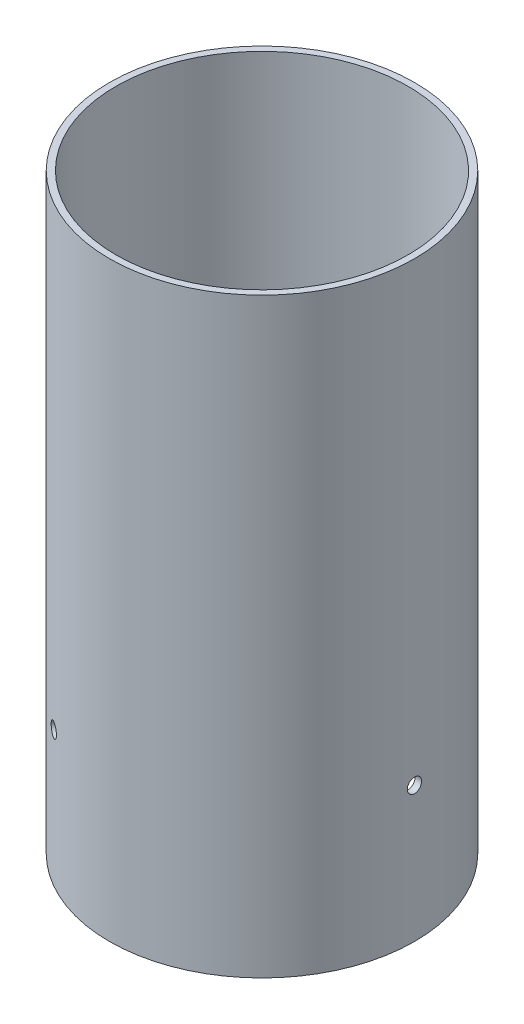
ISO-10303-21;
HEADER;
FILE_DESCRIPTION(('STEP AP214'),'2;1');
FILE_NAME('part.step','',(''),(''),'','','');
FILE_SCHEMA(('AUTOMOTIVE_DESIGN { 1 0 10303 214 1 1 1 1 }'));
ENDSEC;
DATA;
#1=APPLICATION_CONTEXT('core data for automotive mechanical design processes');
#2=APPLICATION_PROTOCOL_DEFINITION('international standard','automotive_design',2000,#1);
#3=PRODUCT_CONTEXT('',#1,'mechanical');
#4=PRODUCT('Part','Part','',(#3));
#5=PRODUCT_RELATED_PRODUCT_CATEGORY('part','',(#4));
#6=PRODUCT_DEFINITION_FORMATION('','',#4);
#7=PRODUCT_DEFINITION_CONTEXT('part definition',#1,'design');
#8=PRODUCT_DEFINITION('design','',#6,#7);
#9=PRODUCT_DEFINITION_SHAPE('','',#8);
#10=(LENGTH_UNIT() NAMED_UNIT(*) SI_UNIT(.MILLI.,.METRE.));
#11=(NAMED_UNIT(*) PLANE_ANGLE_UNIT() SI_UNIT($,.RADIAN.));
#12=(NAMED_UNIT(*) SI_UNIT($,.STERADIAN.) SOLID_ANGLE_UNIT());
#13=UNCERTAINTY_MEASURE_WITH_UNIT(LENGTH_MEASURE(1.E-05),#10,'distance_accuracy_value','');
#14=(GEOMETRIC_REPRESENTATION_CONTEXT(3) GLOBAL_UNCERTAINTY_ASSIGNED_CONTEXT((#13)) GLOBAL_UNIT_ASSIGNED_CONTEXT((#10,
#11,#12)) REPRESENTATION_CONTEXT('',''));
#15=CARTESIAN_POINT('',(0.,0.,0.));
#16=DIRECTION('',(0.,0.,1.));
#17=DIRECTION('',(1.,0.,0.));
#18=AXIS2_PLACEMENT_3D('',#15,#16,#17);
#19=CARTESIAN_POINT('',(0.,147.8153,0.));
#20=DIRECTION('',(0.,1.,0.));
#21=DIRECTION('',(0.,0.,1.));
#22=AXIS2_PLACEMENT_3D('',#19,#20,#21);
#23=PLANE('',#22);
#24=CARTESIAN_POINT('',(0.,147.8153,0.));
#25=DIRECTION('',(0.,1.,0.));
#26=DIRECTION('',(0.,0.,1.));
#27=AXIS2_PLACEMENT_3D('',#24,#25,#26);
#28=CIRCLE('',#27,38.1381);
#29=CARTESIAN_POINT('',(0.,147.8153,38.1381));
#30=VERTEX_POINT('',#29);
#31=EDGE_CURVE('E10',#30,#30,#28,.T.);
#32=ORIENTED_EDGE('',*,*,#31,.T.);
#33=EDGE_LOOP('',(#32));
#34=FACE_BOUND('',#33,.T.);
#35=CARTESIAN_POINT('',(0.,147.8153,0.));
#36=DIRECTION('',(0.,1.,0.));
#37=DIRECTION('',(0.,0.,1.));
#38=AXIS2_PLACEMENT_3D('',#35,#36,#37);
#39=CIRCLE('',#38,36.5125);
#40=CARTESIAN_POINT('',(0.,147.8153,36.5125));
#41=VERTEX_POINT('',#40);
#42=EDGE_CURVE('E44',#41,#41,#39,.T.);
#43=ORIENTED_EDGE('',*,*,#42,.F.);
#44=EDGE_LOOP('',(#43));
#45=FACE_BOUND('',#44,.T.);
#46=ADVANCED_FACE('F33',(#34,#45),#23,.T.);
#47=CARTESIAN_POINT('',(0.,0.,0.));
#48=DIRECTION('',(0.,1.,0.));
#49=DIRECTION('',(0.,0.,1.));
#50=AXIS2_PLACEMENT_3D('',#47,#48,#49);
#51=PLANE('',#50);
#52=CARTESIAN_POINT('',(0.,0.,0.));
#53=DIRECTION('',(0.,1.,0.));
#54=DIRECTION('',(0.,0.,1.));
#55=AXIS2_PLACEMENT_3D('',#52,#53,#54);
#56=CIRCLE('',#55,38.1381);
#57=CARTESIAN_POINT('',(0.,0.,38.1381));
#58=VERTEX_POINT('',#57);
#59=EDGE_CURVE('E37',#58,#58,#56,.T.);
#60=ORIENTED_EDGE('',*,*,#59,.F.);
#61=EDGE_LOOP('',(#60));
#62=FACE_BOUND('',#61,.T.);
#63=CARTESIAN_POINT('',(0.,0.,0.));
#64=DIRECTION('',(0.,1.,0.));
#65=DIRECTION('',(0.,0.,1.));
#66=AXIS2_PLACEMENT_3D('',#63,#64,#65);
#67=CIRCLE('',#66,36.5125);
#68=CARTESIAN_POINT('',(0.,0.,36.5125));
#69=VERTEX_POINT('',#68);
#70=EDGE_CURVE('E46',#69,#69,#67,.T.);
#71=ORIENTED_EDGE('',*,*,#70,.T.);
#72=EDGE_LOOP('',(#71));
#73=FACE_BOUND('',#72,.T.);
#74=ADVANCED_FACE('F116',(#62,#73),#51,.F.);
#75=CARTESIAN_POINT('',(0.,147.8153,0.));
#76=DIRECTION('',(0.,-1.,0.));
#77=DIRECTION('',(0.,0.,-1.));
#78=AXIS2_PLACEMENT_3D('',#75,#76,#77);
#79=CYLINDRICAL_SURFACE('',#78,38.1381);
#80=CARTESIAN_POINT('',(-17.5014632336155,33.8074,33.8852985274205));
#81=CARTESIAN_POINT('',(-17.501467349219,33.9076578687469,33.8852968008197));
#82=CARTESIAN_POINT('',(-17.508999065726,34.0079870339223,33.8814096230945));
#83=CARTESIAN_POINT('',(-17.5389215941936,34.205878197048,33.8659293942136));
#84=CARTESIAN_POINT('',(-17.5613299602515,34.3034367837977,33.85432723954));
#85=CARTESIAN_POINT('',(-17.6203141855438,34.4928914651225,33.8236647641002));
#86=CARTESIAN_POINT('',(-17.6568828784673,34.5847903967336,33.8046082158315));
#87=CARTESIAN_POINT('',(-17.7430638212488,34.7603432783211,33.7594536817781));
#88=CARTESIAN_POINT('',(-17.792672972035,34.8439991807722,33.7333573689586));
#89=CARTESIAN_POINT('',(-17.9034840121713,35.0007921425403,33.6746767440669));
#90=CARTESIAN_POINT('',(-17.9646950271793,35.0739208412828,33.6420873236829));
#91=CARTESIAN_POINT('',(-18.0968533022114,35.2075123586161,33.5711808496157));
#92=CARTESIAN_POINT('',(-18.1678009575859,35.2679746626434,33.5328635633504));
#93=CARTESIAN_POINT('',(-18.3173592830159,35.3745390488251,33.4514015191992));
#94=CARTESIAN_POINT('',(-18.3959733221843,35.4206347796843,33.4082546376291));
#95=CARTESIAN_POINT('',(-18.5585260587089,35.4971167209652,33.3182293245103));
#96=CARTESIAN_POINT('',(-18.6424647194058,35.5275030395305,33.2713509186521));
#97=CARTESIAN_POINT('',(-18.8131603751818,35.5716819567595,33.1751300658714));
#98=CARTESIAN_POINT('',(-18.8999152369714,35.5854868280182,33.1257894695229));
#99=CARTESIAN_POINT('',(-19.0738088012202,35.5961488477628,33.0259676432805));
#100=CARTESIAN_POINT('',(-19.1609475009398,35.5930061170072,32.9754864215167));
#101=CARTESIAN_POINT('',(-19.3330697199145,35.5698723474202,32.8748691177054));
#102=CARTESIAN_POINT('',(-19.418054875546,35.5498945218934,32.8247327960607));
#103=CARTESIAN_POINT('',(-19.583569892321,35.4936781366245,32.7262546252417));
#104=CARTESIAN_POINT('',(-19.6640997364757,35.4574395148824,32.6779127829103));
#105=CARTESIAN_POINT('',(-19.8185219457185,35.3697151326098,32.5844904179342));
#106=CARTESIAN_POINT('',(-19.892411671933,35.3182233448836,32.5394111932713));
#107=CARTESIAN_POINT('',(-20.0315166435133,35.2014587034356,32.4539625790467));
#108=CARTESIAN_POINT('',(-20.0967318355649,35.1361857650204,32.4135932184323));
#109=CARTESIAN_POINT('',(-20.2168010405188,34.9936369669281,32.3388411258981));
#110=CARTESIAN_POINT('',(-20.2716450461268,34.9163496440811,32.3044641786123));
#111=CARTESIAN_POINT('',(-20.369438174186,34.7520062782388,32.2428908495348));
#112=CARTESIAN_POINT('',(-20.4123872937555,34.6649502328769,32.2156944694826));
#113=CARTESIAN_POINT('',(-20.4852583357616,34.4835337335853,32.1694068226873));
#114=CARTESIAN_POINT('',(-20.5151798986683,34.3891730781501,32.1503157796327));
#115=CARTESIAN_POINT('',(-20.561206444117,34.1958290196872,32.1208999508396));
#116=CARTESIAN_POINT('',(-20.577311517821,34.0968456471649,32.1105751072611));
#117=CARTESIAN_POINT('',(-20.595273484249,33.8971665940379,32.0990575866162));
#118=CARTESIAN_POINT('',(-20.597143893939,33.7964726288875,32.0978562460472));
#119=CARTESIAN_POINT('',(-20.5866231403947,33.5961422470756,32.1046049164172));
#120=CARTESIAN_POINT('',(-20.5742320184312,33.4965058273547,32.1125549008735));
#121=CARTESIAN_POINT('',(-20.5355220520146,33.3011638380275,32.1373229722597));
#122=CARTESIAN_POINT('',(-20.50920939702,33.2054565419093,32.1541371182066));
#123=CARTESIAN_POINT('',(-20.4433503288636,33.0206364223301,32.196049659695));
#124=CARTESIAN_POINT('',(-20.4038038486634,32.9315236322774,32.2211480972021));
#125=CARTESIAN_POINT('',(-20.3124821865116,32.7623483055533,32.278795607632));
#126=CARTESIAN_POINT('',(-20.2606977969633,32.6822926507096,32.3113502899361));
#127=CARTESIAN_POINT('',(-20.1462864687058,32.5335732855632,32.3828094851312));
#128=CARTESIAN_POINT('',(-20.0836594686947,32.4649096396729,32.421714033923));
#129=CARTESIAN_POINT('',(-19.9491818321175,32.3408695739021,32.5046311874835));
#130=CARTESIAN_POINT('',(-19.8773240734296,32.2855035096205,32.5486477339441));
#131=CARTESIAN_POINT('',(-19.7263669675379,32.1897010321337,32.6403570320063));
#132=CARTESIAN_POINT('',(-19.6472676489548,32.1492645599254,32.6880497690783));
#133=CARTESIAN_POINT('',(-19.4840319330606,32.084487234282,32.7856096633245));
#134=CARTESIAN_POINT('',(-19.3998976295519,32.0601397402629,32.8354759143297));
#135=CARTESIAN_POINT('',(-19.2289060520162,32.028209756078,32.9359024547704));
#136=CARTESIAN_POINT('',(-19.1420487908613,32.0206271866717,32.9864627409244));
#137=CARTESIAN_POINT('',(-18.9681508668178,32.022443068198,33.0867645792259));
#138=CARTESIAN_POINT('',(-18.8811104591919,32.0318252655729,33.1365068690075));
#139=CARTESIAN_POINT('',(-18.7092530191418,32.0672707808457,33.2338423843089));
#140=CARTESIAN_POINT('',(-18.6244359909555,32.0933341305366,33.2814356057326));
#141=CARTESIAN_POINT('',(-18.4594798888871,32.1613988900873,33.3732106648531));
#142=CARTESIAN_POINT('',(-18.3793408605228,32.2034004549993,33.4173924693574));
#143=CARTESIAN_POINT('',(-18.2260878657308,32.3021463301724,33.5012243290482));
#144=CARTESIAN_POINT('',(-18.1529736764123,32.3588901724648,33.5408745280253));
#145=CARTESIAN_POINT('',(-18.015868143754,32.4855672360272,33.6147177026454));
#146=CARTESIAN_POINT('',(-17.9518846003812,32.5555116169684,33.6489060153489));
#147=CARTESIAN_POINT('',(-17.8350110289078,32.7066001733453,33.7109988811533));
#148=CARTESIAN_POINT('',(-17.7821237373999,32.7877471034271,33.7389018842759));
#149=CARTESIAN_POINT('',(-17.6890181436651,32.9589949189407,33.7878097201873));
#150=CARTESIAN_POINT('',(-17.6488112777457,33.0491037912539,33.8088083267147));
#151=CARTESIAN_POINT('',(-17.5823942894019,33.2355925870745,33.8433966689575));
#152=CARTESIAN_POINT('',(-17.5561676040917,33.3319649373638,33.8569951722755));
#153=CARTESIAN_POINT('',(-17.5254064854518,33.4920150071967,33.8729237871435));
#154=CARTESIAN_POINT('',(-17.516439932421,33.5546556126158,33.8775596798369));
#155=CARTESIAN_POINT('',(-17.5044670077013,33.6806546460333,33.8837475946384));
#156=CARTESIAN_POINT('',(-17.5014606315708,33.7440130734968,33.8852996190447));
#157=CARTESIAN_POINT('',(-17.5014632336155,33.8074,33.8852985274205));
#158=B_SPLINE_CURVE_WITH_KNOTS('',3,(#80,#81,#82,#83,#84,#85,#86,#87,#88,#89,#90,#91,#92,#93,
#94,#95,#96,#97,#98,#99,#100,#101,#102,#103,#104,#105,#106,#107,#108,#109,#110,#111,#112,#113,
#114,#115,#116,#117,#118,#119,#120,#121,#122,#123,#124,#125,#126,#127,#128,#129,#130,#131,#132,
#133,#134,#135,#136,#137,#138,#139,#140,#141,#142,#143,#144,#145,#146,#147,#148,#149,#150,#151,
#152,#153,#154,#155,#156,#157),.UNSPECIFIED.,.T.,.F.,(4,2,2,2,2,2,2,2,2,2,2,2,2,2,2,2,2,2,2,2,2,
2,2,2,2,2,2,2,2,2,2,2,2,2,2,2,2,2,4),(0.,0.30054222269631,0.601439709975831,0.902185116537959,
1.20285911531018,1.50377060360109,1.80469431384009,2.1057508708664,2.40680535539062,
2.70763687982766,3.00846626072007,3.30905975033448,3.60965438607756,3.9103679587644,
4.21108337957105,4.51208750037112,4.8130916940894,5.11410419428654,5.41511470836723,
5.71583935288382,6.01656312714919,6.31715331302587,6.61774502161876,6.91856361444067,
7.21938390808641,7.52043771383772,7.82149032978512,8.12241861117601,8.42334547020756,
8.72398417080085,9.0246234443924,9.32526564277497,9.62589829894312,9.92678625628239,
10.2277483325598,10.5289810714218,10.8298561299779,11.0198707614112,11.2098852512392),.UNSPECIFIED.);
#159=CARTESIAN_POINT('',(-17.5014632336155,33.8074,33.8852985274205));
#160=VERTEX_POINT('',#159);
#161=EDGE_CURVE('E98',#160,#160,#158,.T.);
#162=ORIENTED_EDGE('',*,*,#161,.F.);
#163=EDGE_LOOP('',(#162));
#164=FACE_BOUND('',#163,.T.);
#165=CARTESIAN_POINT('',(-20.5947977227576,33.8074,-32.0993610274207));
#166=CARTESIAN_POINT('',(-20.5947941696758,33.9076578687469,-32.0993637283375));
#167=CARTESIAN_POINT('',(-20.5876619167632,34.0079870339223,-32.1039427973041));
#168=CARTESIAN_POINT('',(-20.5592943810622,34.205878197048,-32.122116352662));
#169=CARTESIAN_POINT('',(-20.5380424373473,34.3034367837977,-32.1357214895887));
#170=CARTESIAN_POINT('',(-20.4819958420273,34.4928914651225,-32.1714720893944));
#171=CARTESIAN_POINT('',(-20.4472080406564,34.5847903967336,-32.193613232315));
#172=CARTESIAN_POINT('',(-20.3650125956794,34.7603432783211,-32.2456708510592));
#173=CARTESIAN_POINT('',(-20.3176079504394,34.8439991807721,-32.2755854794905));
#174=CARTESIAN_POINT('',(-20.2113835185052,35.0007921425403,-32.3422103428224));
#175=CARTESIAN_POINT('',(-20.152554745054,35.0739208412828,-32.3789259266187));
#176=CARTESIAN_POINT('',(-20.025068799703,35.2075123586161,-32.4579251130833));
#177=CARTESIAN_POINT('',(-19.9564112287059,35.2679746626434,-32.500208941844));
#178=CARTESIAN_POINT('',(-19.8110838663118,35.3745390488251,-32.5889992289381));
#179=CARTESIAN_POINT('',(-19.7344105511938,35.4206347796843,-32.6355075431671));
#180=CARTESIAN_POINT('',(-19.575169974787,35.4971167209652,-32.7312696858926));
#181=CARTESIAN_POINT('',(-19.4926027540764,35.5275030395305,-32.7805234954867));
#182=CARTESIAN_POINT('',(-19.3239252233066,35.5716819567595,-32.880239843314));
#183=CARTESIAN_POINT('',(-19.237817582536,35.5854868280182,-32.9307014593514));
#184=CARTESIAN_POINT('',(-19.0644225630336,35.5961488477628,-33.0313867904242));
#185=CARTESIAN_POINT('',(-18.9771351927122,35.5930061170072,-33.0816105071523));
#186=CARTESIAN_POINT('',(-18.803936942064,35.5698723474202,-33.1803640694344));
#187=CARTESIAN_POINT('',(-18.7180250360516,35.5498945218934,-33.2288952123336));
#188=CARTESIAN_POINT('',(-18.5499829300166,35.4936781366245,-33.322996336159));
#189=CARTESIAN_POINT('',(-18.4678527444145,35.4574395148824,-33.3685663057941));
#190=CARTESIAN_POINT('',(-18.3097354984422,35.3697151326098,-33.4555886794188));
#191=CARTESIAN_POINT('',(-18.233750881594,35.3182233448836,-33.4970394470678));
#192=CARTESIAN_POINT('',(-18.0901977251672,35.2014587034356,-33.5747835791368));
#193=CARTESIAN_POINT('',(-18.0226292373148,35.1361857650204,-33.6110769118589));
#194=CARTESIAN_POINT('',(-17.8978574237172,34.9936369669281,-33.6776838472941));
#195=CARTESIAN_POINT('',(-17.8406641112591,34.9163496440811,-33.7079916757531));
#196=CARTESIAN_POINT('',(-17.7384434800528,34.7520062782388,-33.7618963444291));
#197=CARTESIAN_POINT('',(-17.6934161642519,34.6649502328769,-33.7854931830203));
#198=CARTESIAN_POINT('',(-17.6168943652427,34.4835337335853,-33.8254575332002));
#199=CARTESIAN_POINT('',(-17.5854002555193,34.3891730781501,-33.841824845271));
#200=CARTESIAN_POINT('',(-17.5369121277868,34.1958290196872,-33.8669770884814));
#201=CARTESIAN_POINT('',(-17.5199180141057,34.0968456471649,-33.8757620696497));
#202=CARTESIAN_POINT('',(-17.5009625654246,33.8971665940379,-33.8855588285559));
#203=CARTESIAN_POINT('',(-17.4989869691283,33.7964726288875,-33.8865779805784));
#204=CARTESIAN_POINT('',(-17.5100918658825,33.5961422470756,-33.8808410759271));
#205=CARTESIAN_POINT('',(-17.5231723153632,33.4965058273547,-33.8740850417534));
#206=CARTESIAN_POINT('',(-17.5639770775947,33.3011638380275,-33.8529452631501));
#207=CARTESIAN_POINT('',(-17.5916948826249,33.2054565419094,-33.8385649084572));
#208=CARTESIAN_POINT('',(-17.6609217423693,33.0206364223301,-33.8024855531084));
#209=CARTESIAN_POINT('',(-17.7024308669458,32.9315236322775,-33.7807865153784));
#210=CARTESIAN_POINT('',(-17.7980159065189,32.7623483055533,-33.730523391254));
#211=CARTESIAN_POINT('',(-17.8521012831806,32.6822926507096,-33.7019541355377));
#212=CARTESIAN_POINT('',(-17.9711924256823,32.5335732855632,-33.6386006163836));
#213=CARTESIAN_POINT('',(-18.0361982532643,32.4649096396729,-33.603816317807));
#214=CARTESIAN_POINT('',(-18.1752454329457,32.3408695739021,-33.5288138450706));
#215=CARTESIAN_POINT('',(-18.2492937597114,32.2855035096205,-33.4885914738182));
#216=CARTESIAN_POINT('',(-18.4041948945424,32.1897010321337,-33.4037134342652));
#217=CARTESIAN_POINT('',(-18.4850476757143,32.1492645599254,-33.3590577834863));
#218=CARTESIAN_POINT('',(-18.6511548804692,32.084487234282,-33.2664714538401));
#219=CARTESIAN_POINT('',(-18.7364074723854,32.0601397402629,-33.2185421351744));
#220=CARTESIAN_POINT('',(-18.9088751963892,32.028209756078,-33.1206723554156));
#221=CARTESIAN_POINT('',(-18.9960903191986,32.0206271866717,-33.0707319038294));
#222=CARTESIAN_POINT('',(-19.1699032212357,32.022443068198,-32.970282803093));
#223=CARTESIAN_POINT('',(-19.2565015116419,32.0318252655729,-32.9197747438241));
#224=CARTESIAN_POINT('',(-19.4267252606085,32.0672707808457,-32.8196095925621));
#225=CARTESIAN_POINT('',(-19.5103507135025,32.0933341305366,-32.7699525021911));
#226=CARTESIAN_POINT('',(-19.6723082971688,32.1613988900873,-32.6729838568508));
#227=CARTESIAN_POINT('',(-19.7506403764367,32.2034004549993,-32.6256723247049));
#228=CARTESIAN_POINT('',(-19.8998673939714,32.3021463301724,-32.5348672678544));
#229=CARTESIAN_POINT('',(-19.9707625682099,32.3588901724648,-32.491373622016));
#230=CARTESIAN_POINT('',(-20.1032653996562,32.4855672360272,-32.4095583350445));
#231=CARTESIAN_POINT('',(-20.1648651186564,32.5555116169684,-32.3712411174113));
#232=CARTESIAN_POINT('',(-20.2770759035736,32.7066001733453,-32.3010720683865));
#233=CARTESIAN_POINT('',(-20.3276842588735,32.7877471034271,-32.2692218319646));
#234=CARTESIAN_POINT('',(-20.4165924840843,32.9589949189407,-32.2130439405115));
#235=CARTESIAN_POINT('',(-20.4548812437407,33.0491037912539,-32.1887230764825));
#236=CARTESIAN_POINT('',(-20.5180441209697,33.2355925870745,-32.1484984484553));
#237=CARTESIAN_POINT('',(-20.5429341129517,33.3319649373638,-32.1325847243787));
#238=CARTESIAN_POINT('',(-20.5721092573945,33.4920150071967,-32.1139091216217));
#239=CARTESIAN_POINT('',(-20.5806073347516,33.5546556126158,-32.1084618052593));
#240=CARTESIAN_POINT('',(-20.5919526885259,33.6806546460333,-32.1011869056952));
#241=CARTESIAN_POINT('',(-20.5947999691543,33.7440130734968,-32.099359319796));
#242=CARTESIAN_POINT('',(-20.5947977227576,33.8074,-32.0993610274207));
#243=B_SPLINE_CURVE_WITH_KNOTS('',3,(#165,#166,#167,#168,#169,#170,#171,#172,#173,#174,#175,
#176,#177,#178,#179,#180,#181,#182,#183,#184,#185,#186,#187,#188,#189,#190,#191,#192,#193,#194,
#195,#196,#197,#198,#199,#200,#201,#202,#203,#204,#205,#206,#207,#208,#209,#210,#211,#212,#213,
#214,#215,#216,#217,#218,#219,#220,#221,#222,#223,#224,#225,#226,#227,#228,#229,#230,#231,#232,
#233,#234,#235,#236,#237,#238,#239,#240,#241,#242),.UNSPECIFIED.,.T.,.F.,(4,2,2,2,2,2,2,2,2,2,2,
2,2,2,2,2,2,2,2,2,2,2,2,2,2,2,2,2,2,2,2,2,2,2,2,2,2,2,4),(0.,0.30054222269631,0.601439709975832,
0.902185116537959,1.20285911531018,1.50377060360109,1.80469431384009,2.10575087086639,
2.40680535539062,2.70763687982766,3.00846626072008,3.30905975033448,3.60965438607756,
3.9103679587644,4.21108337957105,4.51208750037112,4.81309169408941,5.11410419428654,
5.41511470836724,5.71583935288383,6.01656312714919,6.31715331302586,6.61774502161876,
6.91856361444067,7.21938390808641,7.52043771383773,7.82149032978512,8.12241861117601,
8.42334547020756,8.72398417080085,9.0246234443924,9.32526564277497,9.62589829894312,
9.92678625628239,10.2277483325598,10.5289810714218,10.8298561299779,11.0198707614112,
11.2098852512392),.UNSPECIFIED.);
#244=CARTESIAN_POINT('',(-20.5947977227576,33.8074,-32.0993610274207));
#245=VERTEX_POINT('',#244);
#246=EDGE_CURVE('E75',#245,#245,#243,.T.);
#247=ORIENTED_EDGE('',*,*,#246,.F.);
#248=EDGE_LOOP('',(#247));
#249=FACE_BOUND('',#248,.T.);
#250=CARTESIAN_POINT('',(38.0962609563733,33.8074,-1.7859375));
#251=CARTESIAN_POINT('',(38.0962615188949,33.9076578687469,-1.78593307248244));
#252=CARTESIAN_POINT('',(38.0966609824894,34.0079870339223,-1.77746682579068));
#253=CARTESIAN_POINT('',(38.0982159752559,34.205878197048,-1.74381304155182));
#254=CARTESIAN_POINT('',(38.0993723975989,34.3034367837977,-1.71860574995165));
#255=CARTESIAN_POINT('',(38.1023100275712,34.4928914651225,-1.65219267470606));
#256=CARTESIAN_POINT('',(38.1040909191239,34.5847903967336,-1.61099498351676));
#257=CARTESIAN_POINT('',(38.1080764169283,34.7603432783211,-1.5137828307192));
#258=CARTESIAN_POINT('',(38.1102809224746,34.8439991807722,-1.45777188946837));
#259=CARTESIAN_POINT('',(38.1148675306766,35.0007921425403,-1.33246640124479));
#260=CARTESIAN_POINT('',(38.1172497722334,35.0739208412828,-1.26316139706439));
#261=CARTESIAN_POINT('',(38.1219221019145,35.2075123586161,-1.11325573653268));
#262=CARTESIAN_POINT('',(38.124212186292,35.2679746626434,-1.03265462150673));
#263=CARTESIAN_POINT('',(38.1284431493278,35.3745390488251,-0.862402290261317));
#264=CARTESIAN_POINT('',(38.1303838733782,35.4206347796843,-0.772747094462273));
#265=CARTESIAN_POINT('',(38.133696033496,35.4971167209652,-0.586959638617963));
#266=CARTESIAN_POINT('',(38.1350674734823,35.5275030395305,-0.490827423165673));
#267=CARTESIAN_POINT('',(38.1370855984884,35.5716819567595,-0.294890222557718));
#268=CARTESIAN_POINT('',(38.1377328195076,35.5854868280182,-0.195088010171746));
#269=CARTESIAN_POINT('',(38.1382313642539,35.5961488477628,0.00541914714346489));
#270=CARTESIAN_POINT('',(38.1380826936522,35.5930061170072,0.106124085635308));
#271=CARTESIAN_POINT('',(38.1370066619786,35.5698723474202,0.305494951728732));
#272=CARTESIAN_POINT('',(38.1360799115978,35.5498945218934,0.404162416272602));
#273=CARTESIAN_POINT('',(38.1335528223378,35.4936781366245,0.596741710917084));
#274=CARTESIAN_POINT('',(38.1319524808904,35.4574395148824,0.690653522883571));
#275=CARTESIAN_POINT('',(38.1282574441608,35.3697151326098,0.871098261484329));
#276=CARTESIAN_POINT('',(38.1261625535272,35.3182233448836,0.957628253796231));
#277=CARTESIAN_POINT('',(38.1217143686807,35.2014587034356,1.12082100008981));
#278=CARTESIAN_POINT('',(38.1193610728798,35.1361857650204,1.19748369342633));
#279=CARTESIAN_POINT('',(38.1146584642361,34.9936369669281,1.33884272139567));
#280=CARTESIAN_POINT('',(38.1123091573861,34.9163496440811,1.40352749714048));
#281=CARTESIAN_POINT('',(38.107881654239,34.7520062782388,1.519005494894));
#282=CARTESIAN_POINT('',(38.1058034580075,34.6649502328769,1.56979871353748));
#283=CARTESIAN_POINT('',(38.1021527010044,34.4835337335853,1.65605071051264));
#284=CARTESIAN_POINT('',(38.1005801541877,34.3891730781501,1.69150906563811));
#285=CARTESIAN_POINT('',(38.0981185719039,34.1958290196872,1.74607713764162));
#286=CARTESIAN_POINT('',(38.0972295319268,34.0968456471649,1.76518696238839));
#287=CARTESIAN_POINT('',(38.0962360496738,33.8971665940379,1.78650124193938));
#288=CARTESIAN_POINT('',(38.0961308630674,33.7964726288875,1.78872173453091));
#289=CARTESIAN_POINT('',(38.0967150062774,33.5961422470756,1.77623615950963));
#290=CARTESIAN_POINT('',(38.0974043337945,33.4965058273547,1.76153014087967));
#291=CARTESIAN_POINT('',(38.0994991296094,33.3011638380275,1.71562229089013));
#292=CARTESIAN_POINT('',(38.1009042796451,33.2054565419094,1.68442779025039));
#293=CARTESIAN_POINT('',(38.104272071233,33.0206364223301,1.60643589341315));
#294=CARTESIAN_POINT('',(38.1062347156094,32.9315236322775,1.55963841817599));
#295=CARTESIAN_POINT('',(38.1104980930306,32.7623483055533,1.45172778362177));
#296=CARTESIAN_POINT('',(38.112799080144,32.6822926507096,1.39060384560135));
#297=CARTESIAN_POINT('',(38.1174788943882,32.5335732855632,1.2557911312521));
#298=CARTESIAN_POINT('',(38.1198577219591,32.4649096396729,1.18210228388381));
#299=CARTESIAN_POINT('',(38.1244272650634,32.3408695739021,1.02418265758683));
#300=CARTESIAN_POINT('',(38.1266178331412,32.2855035096205,0.939943739873793));
#301=CARTESIAN_POINT('',(38.1305618620804,32.1897010321337,0.763356402258667));
#302=CARTESIAN_POINT('',(38.1323153246693,32.1492645599254,0.671008014407706));
#303=CARTESIAN_POINT('',(38.1351868135299,32.084487234282,0.480861790515269));
#304=CARTESIAN_POINT('',(38.1363051019375,32.0601397402629,0.383066220844478));
#305=CARTESIAN_POINT('',(38.1377812484055,32.028209756078,0.184769900644984));
#306=CARTESIAN_POINT('',(38.1381391100601,32.0206271866717,0.084269162904701));
#307=CARTESIAN_POINT('',(38.1380540880537,32.022443068198,-0.116481776133133));
#308=CARTESIAN_POINT('',(38.137611970834,32.0318252655729,-0.21673212518367));
#309=CARTESIAN_POINT('',(38.1359782797504,32.0672707808457,-0.414232791747113));
#310=CARTESIAN_POINT('',(38.1347867044582,32.0933341305366,-0.511483103541785));
#311=CARTESIAN_POINT('',(38.1317881860561,32.1613988900873,-0.700226808002504));
#312=CARTESIAN_POINT('',(38.1299812369597,32.2034004549993,-0.791720144652742));
#313=CARTESIAN_POINT('',(38.1259552597024,32.3021463301724,-0.966357061194046));
#314=CARTESIAN_POINT('',(38.1237362446224,32.3588901724648,-1.04950090600953));
#315=CARTESIAN_POINT('',(38.1191335434104,32.4855672360272,-1.20515936760108));
#316=CARTESIAN_POINT('',(38.1167497190378,32.5555116169684,-1.27766489793787));
#317=CARTESIAN_POINT('',(38.1120869324815,32.7066001733453,-1.40992681276709));
#318=CARTESIAN_POINT('',(38.1098079962735,32.7877471034271,-1.46968005231157));
#319=CARTESIAN_POINT('',(38.1056106277495,32.9589949189407,-1.57476577967603));
#320=CARTESIAN_POINT('',(38.1036925214866,33.0491037912539,-1.62008525023241));
#321=CARTESIAN_POINT('',(38.1004384103717,33.2355925870745,-1.69489822050243));
#322=CARTESIAN_POINT('',(38.0991017170436,33.3319649373638,-1.72441044789715));
#323=CARTESIAN_POINT('',(38.0975157428464,33.4920150071967,-1.75901466552216));
#324=CARTESIAN_POINT('',(38.0970472671726,33.5546556126158,-1.76909787457792));
#325=CARTESIAN_POINT('',(38.0964196962274,33.6806546460333,-1.78256068894342));
#326=CARTESIAN_POINT('',(38.0962606007252,33.7440130734968,-1.78594029924891));
#327=CARTESIAN_POINT('',(38.0962609563733,33.8074,-1.7859375));
#328=B_SPLINE_CURVE_WITH_KNOTS('',3,(#250,#251,#252,#253,#254,#255,#256,#257,#258,#259,#260,
#261,#262,#263,#264,#265,#266,#267,#268,#269,#270,#271,#272,#273,#274,#275,#276,#277,#278,#279,
#280,#281,#282,#283,#284,#285,#286,#287,#288,#289,#290,#291,#292,#293,#294,#295,#296,#297,#298,
#299,#300,#301,#302,#303,#304,#305,#306,#307,#308,#309,#310,#311,#312,#313,#314,#315,#316,#317,
#318,#319,#320,#321,#322,#323,#324,#325,#326,#327),.UNSPECIFIED.,.T.,.F.,(4,2,2,2,2,2,2,2,2,2,2,
2,2,2,2,2,2,2,2,2,2,2,2,2,2,2,2,2,2,2,2,2,2,2,2,2,2,2,4),(0.,0.30054222269631,0.601439709975833,
0.902185116537965,1.20285911531018,1.50377060360109,1.80469431384009,2.10575087086639,
2.40680535539062,2.70763687982766,3.00846626072007,3.30905975033448,3.60965438607756,
3.91036795876441,4.21108337957105,4.51208750037112,4.81309169408941,5.11410419428654,
5.41511470836724,5.71583935288383,6.01656312714919,6.31715331302585,6.61774502161876,
6.91856361444067,7.21938390808641,7.52043771383772,7.82149032978512,8.12241861117601,
8.42334547020756,8.72398417080085,9.0246234443924,9.32526564277497,9.62589829894312,
9.92678625628239,10.2277483325598,10.5289810714218,10.8298561299779,11.0198707614112,
11.2098852512392),.UNSPECIFIED.);
#329=CARTESIAN_POINT('',(38.0962609563733,33.8074,-1.7859375));
#330=VERTEX_POINT('',#329);
#331=EDGE_CURVE('E59',#330,#330,#328,.T.);
#332=ORIENTED_EDGE('',*,*,#331,.F.);
#333=EDGE_LOOP('',(#332));
#334=FACE_BOUND('',#333,.T.);
#335=ORIENTED_EDGE('',*,*,#31,.F.);
#336=EDGE_LOOP('',(#335));
#337=FACE_BOUND('',#336,.T.);
#338=ORIENTED_EDGE('',*,*,#59,.T.);
#339=EDGE_LOOP('',(#338));
#340=FACE_BOUND('',#339,.T.);
#341=ADVANCED_FACE('F35',(#164,#249,#334,#337,#340),#79,.T.);
#342=CARTESIAN_POINT('',(0.,147.8153,0.));
#343=DIRECTION('',(0.,-1.,0.));
#344=DIRECTION('',(0.,0.,-1.));
#345=AXIS2_PLACEMENT_3D('',#342,#343,#344);
#346=CYLINDRICAL_SURFACE('',#345,36.5125);
#347=CARTESIAN_POINT('',(-16.6877307678126,33.8074,32.4758725528815));
#348=CARTESIAN_POINT('',(-16.687734894034,33.9076524942413,32.4758708487192));
#349=CARTESIAN_POINT('',(-16.6952747189043,34.0079761535348,32.4719995230256));
#350=CARTESIAN_POINT('',(-16.7252285602174,34.205856087648,32.4565811301846));
#351=CARTESIAN_POINT('',(-16.7476601184195,34.3034089571194,32.4450250106855));
#352=CARTESIAN_POINT('',(-16.8067025521695,34.4928521743818,32.414479850027));
#353=CARTESIAN_POINT('',(-16.8433062190425,34.5847453734778,32.3954945876654));
#354=CARTESIAN_POINT('',(-16.9295644540327,34.7602879247765,32.3505001263435));
#355=CARTESIAN_POINT('',(-16.9792159344468,34.8439392209554,32.3244925891313));
#356=CARTESIAN_POINT('',(-17.0901173626573,35.0007299309485,32.2659955161129));
#357=CARTESIAN_POINT('',(-17.1513771592365,35.0738603252041,32.2335004748843));
#358=CARTESIAN_POINT('',(-17.2836312210177,35.2074564680845,32.1627790982441));
#359=CARTESIAN_POINT('',(-17.3546258827149,35.2679217006111,32.1245525293849));
#360=CARTESIAN_POINT('',(-17.5042745439388,35.3744955098075,32.0432562693863));
#361=CARTESIAN_POINT('',(-17.5829322297808,35.420597131617,32.0001842457731));
#362=CARTESIAN_POINT('',(-17.7455613037914,35.4970904061227,31.9102857075174));
#363=CARTESIAN_POINT('',(-17.829532653014,35.527482173948,31.8634592203924));
#364=CARTESIAN_POINT('',(-18.0002731950428,35.5716693977292,31.7673166502914));
#365=CARTESIAN_POINT('',(-18.0870400721756,35.5854782447568,31.7180026096497));
#366=CARTESIAN_POINT('',(-18.2609407297262,35.5961489674964,31.6182028073521));
#367=CARTESIAN_POINT('',(-18.348074507347,35.5930109721574,31.5677170546145));
#368=CARTESIAN_POINT('',(-18.5201638246828,35.5698882070027,31.467064037214));
#369=CARTESIAN_POINT('',(-18.6051211641589,35.5499178523158,31.4168965370283));
#370=CARTESIAN_POINT('',(-18.7705666797176,35.4937195967668,31.3183294783321));
#371=CARTESIAN_POINT('',(-18.8510548376546,35.4574916299016,31.2699299269999));
#372=CARTESIAN_POINT('',(-19.0053872351895,35.3697900856106,31.1763703524817));
#373=CARTESIAN_POINT('',(-19.0792285935032,35.318309937702,31.1312117358936));
#374=CARTESIAN_POINT('',(-19.2182331711668,35.201570166033,31.045593001796));
#375=CARTESIAN_POINT('',(-19.2833963320112,35.1363104493827,31.0051329159629));
#376=CARTESIAN_POINT('',(-19.4033695763522,34.9937825254812,30.9301943906912));
#377=CARTESIAN_POINT('',(-19.4581687443805,34.9165018119395,30.895722260913));
#378=CARTESIAN_POINT('',(-19.5558791454023,34.7521695558778,30.8339682636942));
#379=CARTESIAN_POINT('',(-19.5987903753372,34.665118010844,30.8066863981034));
#380=CARTESIAN_POINT('',(-19.6715975421787,34.4837075898271,30.7602467544291));
#381=CARTESIAN_POINT('',(-19.7014930803861,34.3893484901017,30.7410892252124));
#382=CARTESIAN_POINT('',(-19.7474826018266,34.1960048894091,30.7115668820616));
#383=CARTESIAN_POINT('',(-19.7635766844002,34.0970204217398,30.7012020048396));
#384=CARTESIAN_POINT('',(-19.7815326245429,33.8973457102865,30.6896357051856));
#385=CARTESIAN_POINT('',(-19.7834092109276,33.7966573401288,30.6884247995705));
#386=CARTESIAN_POINT('',(-19.7729199789553,33.5963364695899,30.6951841366732));
#387=CARTESIAN_POINT('',(-19.7605542056371,33.4967039658708,30.7031543503574));
#388=CARTESIAN_POINT('',(-19.7219131158681,33.3013721561737,30.7279892106396));
#389=CARTESIAN_POINT('',(-19.695644550285,33.2056709655263,30.7448495403924));
#390=CARTESIAN_POINT('',(-19.6298885464345,33.0208603422332,30.786874567353));
#391=CARTESIAN_POINT('',(-19.5904010350053,32.9317509460739,30.8120393105225));
#392=CARTESIAN_POINT('',(-19.4992037624182,32.7625728956644,30.8698334055762));
#393=CARTESIAN_POINT('',(-19.4474839655503,32.6825117449797,30.9024688859527));
#394=CARTESIAN_POINT('',(-19.3332032983535,32.5337782994509,30.9740930769361));
#395=CARTESIAN_POINT('',(-19.2706423615222,32.4651060744746,31.0130818265156));
#396=CARTESIAN_POINT('',(-19.1362866939165,32.3410410613286,31.0961640674315));
#397=CARTESIAN_POINT('',(-19.0644841844913,32.2856595737907,31.1402618558985));
#398=CARTESIAN_POINT('',(-18.9136248145249,32.1898253648867,31.2321187453128));
#399=CARTESIAN_POINT('',(-18.8345679845436,32.1493725806352,31.2798778308362));
#400=CARTESIAN_POINT('',(-18.6714029045032,32.0845638505003,31.3775460922595));
#401=CARTESIAN_POINT('',(-18.5872969436135,32.0602006691639,31.4274542909384));
#402=CARTESIAN_POINT('',(-18.4163423976937,32.0282390295947,31.5279370627727));
#403=CARTESIAN_POINT('',(-18.329493827261,32.0206404821471,31.5785116323806));
#404=CARTESIAN_POINT('',(-18.1556007588238,32.0224246637604,31.678808086799));
#405=CARTESIAN_POINT('',(-18.0685565602443,32.0317896628802,31.7285308071196));
#406=CARTESIAN_POINT('',(-17.8966724611017,32.0671984586725,31.825799701844));
#407=CARTESIAN_POINT('',(-17.8118325647086,32.0932422868953,31.8733458721303));
#408=CARTESIAN_POINT('',(-17.6468143737763,32.1612658647812,31.9650045317767));
#409=CARTESIAN_POINT('',(-17.5666361175233,32.2032457453066,32.0091169929365));
#410=CARTESIAN_POINT('',(-17.4132919157933,32.3019466142615,32.0927960813912));
#411=CARTESIAN_POINT('',(-17.340125752591,32.3586671447909,32.1323628498373));
#412=CARTESIAN_POINT('',(-17.202902270451,32.485302401285,32.2060381252149));
#413=CARTESIAN_POINT('',(-17.1388535389764,32.5552294237629,32.2401414900546));
#414=CARTESIAN_POINT('',(-17.0218490246527,32.7062857978436,32.3020697005042));
#415=CARTESIAN_POINT('',(-16.9688959761221,32.7874179025711,32.3298929986421));
#416=CARTESIAN_POINT('',(-16.8756624281285,32.9586430546022,32.3786573748688));
#417=CARTESIAN_POINT('',(-16.8353938697942,33.0487444411883,32.3995919687813));
#418=CARTESIAN_POINT('',(-16.7688657476846,33.2352230871261,32.434074907404));
#419=CARTESIAN_POINT('',(-16.7425896262849,33.3315927767438,32.4476319825474));
#420=CARTESIAN_POINT('',(-16.7117500353616,33.4917015852751,32.4635215976089));
#421=CARTESIAN_POINT('',(-16.7027550693519,33.5544034921245,32.4681486335632));
#422=CARTESIAN_POINT('',(-16.6907441322637,33.6805274308069,32.4743246492297));
#423=CARTESIAN_POINT('',(-16.6877281562969,33.7439494620511,32.4758736314583));
#424=CARTESIAN_POINT('',(-16.6877307678126,33.8074,32.4758725528815));
#425=B_SPLINE_CURVE_WITH_KNOTS('',3,(#347,#348,#349,#350,#351,#352,#353,#354,#355,#356,#357,
#358,#359,#360,#361,#362,#363,#364,#365,#366,#367,#368,#369,#370,#371,#372,#373,#374,#375,#376,
#377,#378,#379,#380,#381,#382,#383,#384,#385,#386,#387,#388,#389,#390,#391,#392,#393,#394,#395,
#396,#397,#398,#399,#400,#401,#402,#403,#404,#405,#406,#407,#408,#409,#410,#411,#412,#413,#414,
#415,#416,#417,#418,#419,#420,#421,#422,#423,#424),.UNSPECIFIED.,.T.,.F.,(4,2,2,2,2,2,2,2,2,2,2,
2,2,2,2,2,2,2,2,2,2,2,2,2,2,2,2,2,2,2,2,2,2,2,2,2,2,2,4),(0.,0.300525864910744,
0.601406364738192,0.902134021660894,1.20279057680056,1.50370336785932,1.8046284185612,
2.10569895154031,2.40676727810439,2.70759232156549,3.00841507604152,3.30898046921384,
3.60954708264206,3.91024336581389,4.21094167608044,4.51195494257795,4.81296828651917,
5.11399085051239,5.41501124778096,5.71571975602545,6.01642731333721,6.31698898794435,
6.61755232607057,6.9183631154498,7.2191757501461,7.52024325584009,7.82130949330748,
8.12224024970756,8.42316940466808,8.72378421628565,9.02439959656144,9.32501744545925,
9.62562595714973,9.92651575661407,10.2274796176283,10.5287259638893,10.829615040678,
11.0198202174229,11.2100252386589),.UNSPECIFIED.);
#426=CARTESIAN_POINT('',(-16.6877307678126,33.8074,32.4758725528815));
#427=VERTEX_POINT('',#426);
#428=EDGE_CURVE('E81',#427,#427,#425,.T.);
#429=ORIENTED_EDGE('',*,*,#428,.T.);
#430=EDGE_LOOP('',(#429));
#431=FACE_BOUND('',#430,.T.);
#432=CARTESIAN_POINT('',(-19.7810652569547,33.8074,-30.6899350528817));
#433=CARTESIAN_POINT('',(-19.7810617179962,33.9076524942413,-30.6899377742131));
#434=CARTESIAN_POINT('',(-19.7739391391641,34.0079761535348,-30.6945317912441));
#435=CARTESIAN_POINT('',(-19.7456094986217,34.205856087648,-30.7127633823417));
#436=CARTESIAN_POINT('',(-19.7243858264652,34.3034089571194,-30.7264116218416));
#437=CARTESIAN_POINT('',(-19.6684117244973,34.4928521743818,-30.7622712890411));
#438=CARTESIAN_POINT('',(-19.6336681715581,34.5847453734778,-30.784478363244));
#439=CARTESIAN_POINT('',(-19.5515727075287,34.7602879247765,-30.8366829553702));
#440=CARTESIAN_POINT('',(-19.5042237794059,34.8439392209554,-30.8666786301382));
#441=CARTESIAN_POINT('',(-19.3981131140198,35.0007299309485,-30.9334735477753));
#442=CARTESIAN_POINT('',(-19.3393416845292,35.0738603252041,-30.9702785672293));
#443=CARTESIAN_POINT('',(-19.2119681448776,35.2074564680845,-31.0494532561653));
#444=CARTESIAN_POINT('',(-19.1433656342974,35.2679217006111,-31.0918231522985));
#445=CARTESIAN_POINT('',(-18.998136677294,35.3744955098075,-31.1807745645615));
#446=CARTESIAN_POINT('',(-18.9215063677315,35.420597131617,-31.2273581068969));
#447=CARTESIAN_POINT('',(-18.7623374128337,35.4970904061226,-31.3232497472562));
#448=CARTESIAN_POINT('',(-18.6797988108022,35.527482173948,-31.3725578253105));
#449=CARTESIAN_POINT('',(-18.5111666316952,35.5716693977292,-31.4723521871129));
#450=CARTESIAN_POINT('',(-18.4250759811698,35.5854782447568,-31.5228374865962));
#451=CARTESIAN_POINT('',(-18.2516964883121,35.5961489674964,-31.6235399726209));
#452=CARTESIAN_POINT('',(-18.1644076551018,35.5930109721574,-31.6737571611995));
#453=CARTESIAN_POINT('',(-17.9911949263975,35.5698882070027,-31.772464373032));
#454=CARTESIAN_POINT('',(-17.9052699270543,35.5499178523158,-31.8209558371634));
#455=CARTESIAN_POINT('',(-17.7371855924676,35.4937195967668,-31.9149523272313));
#456=CARTESIAN_POINT('',(-17.6550262725137,35.4574916299016,-31.9604573410424));
#457=CARTESIAN_POINT('',(-17.4968351054463,35.3697900856106,-32.0473333306755));
#458=CARTESIAN_POINT('',(-17.4208059171243,35.318309937702,-32.088702514531));
#459=CARTESIAN_POINT('',(-17.2771556295242,35.201570166033,-32.1662746429813));
#460=CARTESIAN_POINT('',(-17.2095345869312,35.1363104493827,-32.2024775527468));
#461=CARTESIAN_POINT('',(-17.0846492981533,34.9937825254812,-32.2689081674848));
#462=CARTESIAN_POINT('',(-17.0273959740287,34.9165018119395,-32.2991295742145));
#463=CARTESIAN_POINT('',(-16.925060243141,34.7521695558778,-32.3528722651038));
#464=CARTESIAN_POINT('',(-16.8799778395093,34.665118010844,-32.3763935475397));
#465=CARTESIAN_POINT('',(-16.8033563449239,34.4837075898271,-32.4162265817649));
#466=CARTESIAN_POINT('',(-16.7718176688449,34.3893484901017,-32.432538112704));
#467=CARTESIAN_POINT('',(-16.7232558089767,34.1960048894091,-32.457605035004));
#468=CARTESIAN_POINT('',(-16.7062325207085,34.0970204217398,-32.4663604807523));
#469=CARTESIAN_POINT('',(-16.6872378413091,33.8973457102865,-32.4761276312377));
#470=CARTESIAN_POINT('',(-16.6852508730925,33.7966573401288,-32.4771473499117));
#471=CARTESIAN_POINT('',(-16.6963492467223,33.5963364695899,-32.4714430771089));
#472=CARTESIAN_POINT('',(-16.7094345409055,33.4967039658708,-32.4647191101199));
#473=CARTESIAN_POINT('',(-16.7502627056939,33.3013721561737,-32.4436723748912));
#474=CARTESIAN_POINT('',(-16.7779984623675,33.2056709655263,-32.4293532946516));
#475=CARTESIAN_POINT('',(-16.8472712052354,33.0208603422332,-32.393419438346));
#476=CARTESIAN_POINT('',(-16.8888082678145,32.9317509460739,-32.3718046219009));
#477=CARTESIAN_POINT('',(-16.9844580586133,32.7625728956644,-32.3217225146114));
#478=CARTESIAN_POINT('',(-17.0385811121179,32.6825117449797,-32.2932495968335));
#479=CARTESIAN_POINT('',(-17.1577498146335,32.5337782994509,-32.2300917313714));
#480=CARTESIAN_POINT('',(-17.2227955306468,32.4651060744746,-32.1954067455806));
#481=CARTESIAN_POINT('',(-17.3619246956861,32.3410410613286,-32.1205924447497));
#482=CARTESIAN_POINT('',(-17.4360157554619,32.2856595737907,-32.0804585417654));
#483=CARTESIAN_POINT('',(-17.5909958401904,32.1898253648867,-31.9957389396828));
#484=CARTESIAN_POINT('',(-17.6718848365059,32.1493725806352,-31.951153259338));
#485=CARTESIAN_POINT('',(-17.8380505720621,32.0845638505003,-31.8586822857242));
#486=CARTESIAN_POINT('',(-17.92332532042,32.0602006691639,-31.8107984863234));
#487=CARTESIAN_POINT('',(-18.0958232264311,32.0282390295947,-31.7129888925816));
#488=CARTESIAN_POINT('',(-18.1830463737134,32.0206404821471,-31.6630631091085));
#489=CARTESIAN_POINT('',(-18.3568521853678,32.0224246637604,-31.562615521509));
#490=CARTESIAN_POINT('',(-18.4434354236005,32.0317896628802,-31.5120943944474));
#491=CARTESIAN_POINT('',(-18.6136148070011,32.0671984586725,-31.4118728454455));
#492=CARTESIAN_POINT('',(-18.6972109465182,32.0932422868953,-31.3621724250578));
#493=CARTESIAN_POINT('',(-18.859098769715,32.1612658647812,-31.265091809447));
#494=CARTESIAN_POINT('',(-18.9373904098294,32.2032457453066,-31.2177116332808));
#495=CARTESIAN_POINT('',(-19.0865307270617,32.3019466142615,-31.1267512032869));
#496=CARTESIAN_POINT('',(-19.1573796352828,32.3586671447909,-31.0831708314793));
#497=CARTESIAN_POINT('',(-19.2897960364606,32.485302401285,-31.0011694476391));
#498=CARTESIAN_POINT('',(-19.3513547825036,32.5552294237629,-30.9627533015218));
#499=CARTESIAN_POINT('',(-19.4634884431258,32.7062857978436,-30.8923885249848));
#500=CARTESIAN_POINT('',(-19.5140606503955,32.7874179025711,-30.8604414888184));
#501=CARTESIAN_POINT('',(-19.6029086130043,32.9586430546022,-30.8040810558843));
#502=CARTESIAN_POINT('',(-19.6411727823177,33.0487444411883,-30.7796747583493));
#503=CARTESIAN_POINT('',(-19.7042999442168,33.2352230871261,-30.7393011838477));
#504=CARTESIAN_POINT('',(-19.7291787763918,33.3315927767438,-30.7233239327743));
#505=CARTESIAN_POINT('',(-19.7583593821531,33.4917015852751,-30.7045608711231));
#506=CARTESIAN_POINT('',(-19.7668639958387,33.5544034921245,-30.6990845200297));
#507=CARTESIAN_POINT('',(-19.7782180508441,33.6805274308069,-30.6917707512213));
#508=CARTESIAN_POINT('',(-19.7810674967875,33.7439494620511,-30.6899333305312));
#509=CARTESIAN_POINT('',(-19.7810652569547,33.8074,-30.6899350528817));
#510=B_SPLINE_CURVE_WITH_KNOTS('',3,(#432,#433,#434,#435,#436,#437,#438,#439,#440,#441,#442,
#443,#444,#445,#446,#447,#448,#449,#450,#451,#452,#453,#454,#455,#456,#457,#458,#459,#460,#461,
#462,#463,#464,#465,#466,#467,#468,#469,#470,#471,#472,#473,#474,#475,#476,#477,#478,#479,#480,
#481,#482,#483,#484,#485,#486,#487,#488,#489,#490,#491,#492,#493,#494,#495,#496,#497,#498,#499,
#500,#501,#502,#503,#504,#505,#506,#507,#508,#509),.UNSPECIFIED.,.T.,.F.,(4,2,2,2,2,2,2,2,2,2,2,
2,2,2,2,2,2,2,2,2,2,2,2,2,2,2,2,2,2,2,2,2,2,2,2,2,2,2,4),(0.,0.300525864910744,
0.601406364738191,0.902134021660892,1.20279057680056,1.50370336785931,1.80462841856119,
2.1056989515403,2.40676727810439,2.70759232156549,3.00841507604151,3.30898046921384,
3.60954708264205,3.91024336581388,4.21094167608043,4.51195494257795,4.81296828651917,
5.11399085051239,5.41501124778096,5.71571975602545,6.01642731333721,6.31698898794435,
6.61755232607057,6.91836311544979,7.2191757501461,7.52024325584008,7.82130949330748,
8.12224024970756,8.42316940466808,8.72378421628565,9.02439959656144,9.32501744545925,
9.62562595714973,9.92651575661407,10.2274796176283,10.5287259638893,10.829615040678,
11.0198202174229,11.2100252386589),.UNSPECIFIED.);
#511=CARTESIAN_POINT('',(-19.7810652569547,33.8074,-30.6899350528817));
#512=VERTEX_POINT('',#511);
#513=EDGE_CURVE('E82',#512,#512,#510,.T.);
#514=ORIENTED_EDGE('',*,*,#513,.T.);
#515=EDGE_LOOP('',(#514));
#516=FACE_BOUND('',#515,.T.);
#517=CARTESIAN_POINT('',(36.4687960247674,33.8074,-1.7859375));
#518=CARTESIAN_POINT('',(36.4687966120303,33.9076524942413,-1.78593307450633));
#519=CARTESIAN_POINT('',(36.4692138580685,34.0079761535348,-1.77746773178178));
#520=CARTESIAN_POINT('',(36.4708380588392,34.205856087648,-1.74381774784319));
#521=CARTESIAN_POINT('',(36.4720459448849,34.3034089571194,-1.71861338884412));
#522=CARTESIAN_POINT('',(36.4751142766669,34.4928521743818,-1.65220856098612));
#523=CARTESIAN_POINT('',(36.4769743906008,34.5847453734778,-1.6110162244216));
#524=CARTESIAN_POINT('',(36.4811371615615,34.7602879247765,-1.51381717097359));
#525=CARTESIAN_POINT('',(36.4834397138529,34.8439392209554,-1.45781395899331));
#526=CARTESIAN_POINT('',(36.4882304766772,35.0007299309485,-1.33252196833791));
#527=CARTESIAN_POINT('',(36.4907188437658,35.0738603252041,-1.2632219076553));
#528=CARTESIAN_POINT('',(36.4955993658954,35.2074564680845,-1.11332584207907));
#529=CARTESIAN_POINT('',(36.4979915170124,35.2679217006111,-1.03272937708659));
#530=CARTESIAN_POINT('',(36.5024112212329,35.3744955098075,-0.862481704825083));
#531=CARTESIAN_POINT('',(36.5044385975124,35.420597131617,-0.772826138876392));
#532=CARTESIAN_POINT('',(36.5078987166253,35.4970904061227,-0.587035960261428));
#533=CARTESIAN_POINT('',(36.5093314638163,35.527482173948,-0.490901395082085));
#534=CARTESIAN_POINT('',(36.5114398267381,35.5716693977292,-0.294964463178732));
#535=CARTESIAN_POINT('',(36.5121160533456,35.5854782447568,-0.195165123053807));
#536=CARTESIAN_POINT('',(36.5126372180384,35.5961489674964,0.00533716526860272));
#537=CARTESIAN_POINT('',(36.5124821624489,35.5930109721574,0.106040106584733));
#538=CARTESIAN_POINT('',(36.5113587510805,35.5698882070027,0.305400335817671));
#539=CARTESIAN_POINT('',(36.5103910912134,35.5499178523158,0.404059300134782));
#540=CARTESIAN_POINT('',(36.5077522721854,35.4937195967668,0.596622848898981));
#541=CARTESIAN_POINT('',(36.5060811101685,35.4574916299016,0.690527414042287));
#542=CARTESIAN_POINT('',(36.5022223406359,35.3697900856106,0.870962978193539));
#543=CARTESIAN_POINT('',(36.5000345106277,35.318309937702,0.957490778637243));
#544=CARTESIAN_POINT('',(36.4953888006911,35.201570166033,1.12068164118506));
#545=CARTESIAN_POINT('',(36.4929309189425,35.1363104493827,1.19734463678372));
#546=CARTESIAN_POINT('',(36.4880188745056,34.9937825254812,1.33871377679333));
#547=CARTESIAN_POINT('',(36.4855647184093,34.9165018119395,1.40340731330119));
#548=CARTESIAN_POINT('',(36.4809393885435,34.7521695558778,1.51890400140941));
#549=CARTESIAN_POINT('',(36.4787682148467,34.665118010844,1.5697071494361));
#550=CARTESIAN_POINT('',(36.4749538871028,34.4837075898271,1.65597982733557));
#551=CARTESIAN_POINT('',(36.4733107492311,34.3893484901017,1.69144888749129));
#552=CARTESIAN_POINT('',(36.4707384108035,34.1960048894091,1.74603815294211));
#553=CARTESIAN_POINT('',(36.4698092051089,34.0970204217398,1.76515847591248));
#554=CARTESIAN_POINT('',(36.4687704658521,33.8973457102865,1.78649192605183));
#555=CARTESIAN_POINT('',(36.4686600840203,33.7966573401288,1.78872255034097));
#556=CARTESIAN_POINT('',(36.4692692256778,33.5963364695899,1.77625894043541));
#557=CARTESIAN_POINT('',(36.4699887465428,33.4967039658708,1.76156475976228));
#558=CARTESIAN_POINT('',(36.4721758215621,33.3013721561737,1.71568316425129));
#559=CARTESIAN_POINT('',(36.4736430126526,33.2056709655263,1.68450375425897));
#560=CARTESIAN_POINT('',(36.47715975167,33.0208603422332,1.60654487099276));
#561=CARTESIAN_POINT('',(36.47920930282,32.9317509460739,1.55976531137814));
#562=CARTESIAN_POINT('',(36.4836618210316,32.7625728956644,1.45188910903495));
#563=CARTESIAN_POINT('',(36.4860650776684,32.6825117449797,1.39078071088062));
#564=CARTESIAN_POINT('',(36.4909531129871,32.5337782994509,1.25599865443503));
#565=CARTESIAN_POINT('',(36.4934378921691,32.4651060744746,1.18232491906477));
#566=CARTESIAN_POINT('',(36.4982113896028,32.3410410613286,1.02442837731791));
#567=CARTESIAN_POINT('',(36.5004999399533,32.2856595737907,0.940196685866658));
#568=CARTESIAN_POINT('',(36.5046206547155,32.1898253648867,0.763620194369793));
#569=CARTESIAN_POINT('',(36.5064528210497,32.1493725806352,0.671275428501602));
#570=CARTESIAN_POINT('',(36.5094534765655,32.0845638505003,0.481136193464382));
#571=CARTESIAN_POINT('',(36.5106222640336,32.0602006691639,0.383344195384819));
#572=CARTESIAN_POINT('',(36.5121656241249,32.0282390295947,0.185051829808592));
#573=CARTESIAN_POINT('',(36.5125402009745,32.0206404821471,0.0845514767276145));
#574=CARTESIAN_POINT('',(36.5124529441918,32.0224246637604,-0.116192565290231));
#575=CARTESIAN_POINT('',(36.5119919838449,32.0317896628802,-0.216436412672443));
#576=CARTESIAN_POINT('',(36.5102872681029,32.0671984586725,-0.413926856398744));
#577=CARTESIAN_POINT('',(36.509043511227,32.0932422868953,-0.511173447072723));
#578=CARTESIAN_POINT('',(36.5059131434914,32.1612658647812,-0.699912722329889));
#579=CARTESIAN_POINT('',(36.5040265273528,32.2032457453066,-0.791405359656044));
#580=CARTESIAN_POINT('',(36.4998226428551,32.3019466142615,-0.966044878104544));
#581=CARTESIAN_POINT('',(36.4975053878739,32.3586671447909,-1.04919201835828));
#582=CARTESIAN_POINT('',(36.4926983069117,32.485302401285,-1.2048686775761));
#583=CARTESIAN_POINT('',(36.4902083214802,32.5552294237629,-1.27738818853308));
#584=CARTESIAN_POINT('',(36.4853374677786,32.7062857978436,-1.40968117551967));
#585=CARTESIAN_POINT('',(36.4829566265178,32.7874179025711,-1.46945150982394));
#586=CARTESIAN_POINT('',(36.478571041133,32.9586430546022,-1.57457631898469));
#587=CARTESIAN_POINT('',(36.476566652112,33.0487444411883,-1.61991721043226));
#588=CARTESIAN_POINT('',(36.4731656919015,33.2352230871261,-1.69477372355656));
#589=CARTESIAN_POINT('',(36.4717684026769,33.3315927767438,-1.72430804977328));
#590=CARTESIAN_POINT('',(36.4701094175148,33.4917015852751,-1.758960726486));
#591=CARTESIAN_POINT('',(36.4696190651907,33.5544034921245,-1.76906411353376));
#592=CARTESIAN_POINT('',(36.4689621831079,33.6805274308069,-1.78255389800859));
#593=CARTESIAN_POINT('',(36.4687956530845,33.7439494620511,-1.78594030092736));
#594=CARTESIAN_POINT('',(36.4687960247674,33.8074,-1.7859375));
#595=B_SPLINE_CURVE_WITH_KNOTS('',3,(#517,#518,#519,#520,#521,#522,#523,#524,#525,#526,#527,
#528,#529,#530,#531,#532,#533,#534,#535,#536,#537,#538,#539,#540,#541,#542,#543,#544,#545,#546,
#547,#548,#549,#550,#551,#552,#553,#554,#555,#556,#557,#558,#559,#560,#561,#562,#563,#564,#565,
#566,#567,#568,#569,#570,#571,#572,#573,#574,#575,#576,#577,#578,#579,#580,#581,#582,#583,#584,
#585,#586,#587,#588,#589,#590,#591,#592,#593,#594),.UNSPECIFIED.,.T.,.F.,(4,2,2,2,2,2,2,2,2,2,2,
2,2,2,2,2,2,2,2,2,2,2,2,2,2,2,2,2,2,2,2,2,2,2,2,2,2,2,4),(0.,0.300525864910744,
0.601406364738191,0.902134021660896,1.20279057680056,1.50370336785932,1.80462841856119,
2.10569895154031,2.40676727810439,2.70759232156549,3.00841507604152,3.30898046921384,
3.60954708264206,3.91024336581389,4.21094167608043,4.51195494257795,4.81296828651917,
5.11399085051239,5.41501124778096,5.71571975602545,6.01642731333721,6.31698898794434,
6.61755232607057,6.91836311544979,7.21917575014611,7.52024325584009,7.82130949330749,
8.12224024970756,8.42316940466808,8.72378421628565,9.02439959656144,9.32501744545925,
9.62562595714973,9.92651575661407,10.2274796176283,10.5287259638893,10.829615040678,
11.0198202174229,11.2100252386589),.UNSPECIFIED.);
#596=CARTESIAN_POINT('',(36.4687960247674,33.8074,-1.7859375));
#597=VERTEX_POINT('',#596);
#598=EDGE_CURVE('E49',#597,#597,#595,.T.);
#599=ORIENTED_EDGE('',*,*,#598,.T.);
#600=EDGE_LOOP('',(#599));
#601=FACE_BOUND('',#600,.T.);
#602=ORIENTED_EDGE('',*,*,#42,.T.);
#603=EDGE_LOOP('',(#602));
#604=FACE_BOUND('',#603,.T.);
#605=ORIENTED_EDGE('',*,*,#70,.F.);
#606=EDGE_LOOP('',(#605));
#607=FACE_BOUND('',#606,.T.);
#608=ADVANCED_FACE('F123',(#431,#516,#601,#604,#607),#346,.F.);
#609=CARTESIAN_POINT('',(-38.1391,33.8074,0.));
#610=DIRECTION('',(1.,0.,0.));
#611=DIRECTION('',(0.,0.,-1.));
#612=AXIS2_PLACEMENT_3D('',#609,#610,#611);
#613=CYLINDRICAL_SURFACE('',#612,1.7859375);
#614=ORIENTED_EDGE('',*,*,#598,.F.);
#615=EDGE_LOOP('',(#614));
#616=FACE_BOUND('',#615,.T.);
#617=ORIENTED_EDGE('',*,*,#331,.T.);
#618=EDGE_LOOP('',(#617));
#619=FACE_BOUND('',#618,.T.);
#620=ADVANCED_FACE('F65',(#616,#619),#613,.F.);
#621=CARTESIAN_POINT('',(19.0695499999997,33.8074,33.0294294774753));
#622=DIRECTION('',(-0.499999999999992,0.,-0.866025403784443));
#623=DIRECTION('',(-0.866025403784443,0.,0.499999999999992));
#624=AXIS2_PLACEMENT_3D('',#621,#622,#623);
#625=CYLINDRICAL_SURFACE('',#624,1.7859375);
#626=ORIENTED_EDGE('',*,*,#513,.F.);
#627=EDGE_LOOP('',(#626));
#628=FACE_BOUND('',#627,.T.);
#629=ORIENTED_EDGE('',*,*,#246,.T.);
#630=EDGE_LOOP('',(#629));
#631=FACE_BOUND('',#630,.T.);
#632=ADVANCED_FACE('F87',(#628,#631),#625,.F.);
#633=CARTESIAN_POINT('',(19.0695500000002,33.8074,-33.029429477475));
#634=DIRECTION('',(-0.500000000000004,0.,0.866025403784436));
#635=DIRECTION('',(0.866025403784436,0.,0.500000000000004));
#636=AXIS2_PLACEMENT_3D('',#633,#634,#635);
#637=CYLINDRICAL_SURFACE('',#636,1.7859375);
#638=ORIENTED_EDGE('',*,*,#428,.F.);
#639=EDGE_LOOP('',(#638));
#640=FACE_BOUND('',#639,.T.);
#641=ORIENTED_EDGE('',*,*,#161,.T.);
#642=EDGE_LOOP('',(#641));
#643=FACE_BOUND('',#642,.T.);
#644=ADVANCED_FACE('F91',(#640,#643),#637,.F.);
#645=CLOSED_SHELL('',(#46,#74,#341,#608,#620,#632,#644));
#646=MANIFOLD_SOLID_BREP('B2',#645);
#647=ADVANCED_BREP_SHAPE_REPRESENTATION('',(#18,#646),#14);
#648=SHAPE_DEFINITION_REPRESENTATION(#9,#647);
ENDSEC;
END-ISO-10303-21;
